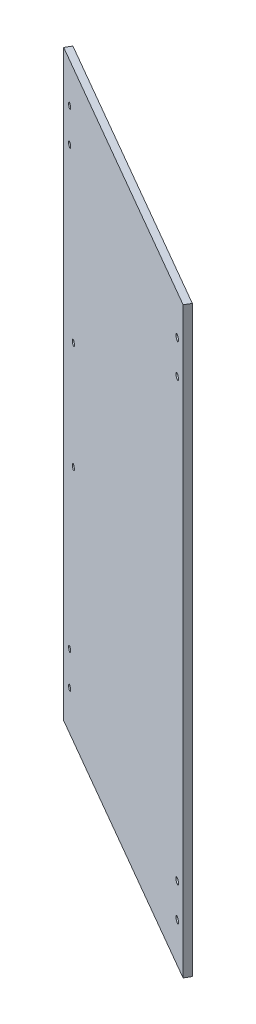
ISO-10303-21;
HEADER;
FILE_DESCRIPTION(('STEP AP214'),'2;1');
FILE_NAME('part.step','',(''),(''),'','','');
FILE_SCHEMA(('AUTOMOTIVE_DESIGN { 1 0 10303 214 1 1 1 1 }'));
ENDSEC;
DATA;
#1=APPLICATION_CONTEXT('core data for automotive mechanical design processes');
#2=APPLICATION_PROTOCOL_DEFINITION('international standard','automotive_design',2000,#1);
#3=PRODUCT_CONTEXT('',#1,'mechanical');
#4=PRODUCT('Part','Part','',(#3));
#5=PRODUCT_RELATED_PRODUCT_CATEGORY('part','',(#4));
#6=PRODUCT_DEFINITION_FORMATION('','',#4);
#7=PRODUCT_DEFINITION_CONTEXT('part definition',#1,'design');
#8=PRODUCT_DEFINITION('design','',#6,#7);
#9=PRODUCT_DEFINITION_SHAPE('','',#8);
#10=(LENGTH_UNIT() NAMED_UNIT(*) SI_UNIT(.MILLI.,.METRE.));
#11=(NAMED_UNIT(*) PLANE_ANGLE_UNIT() SI_UNIT($,.RADIAN.));
#12=(NAMED_UNIT(*) SI_UNIT($,.STERADIAN.) SOLID_ANGLE_UNIT());
#13=UNCERTAINTY_MEASURE_WITH_UNIT(LENGTH_MEASURE(1.E-05),#10,'distance_accuracy_value','');
#14=(GEOMETRIC_REPRESENTATION_CONTEXT(3) GLOBAL_UNCERTAINTY_ASSIGNED_CONTEXT((#13)) GLOBAL_UNIT_ASSIGNED_CONTEXT((#10,
#11,#12)) REPRESENTATION_CONTEXT('',''));
#15=CARTESIAN_POINT('',(0.,0.,0.));
#16=DIRECTION('',(0.,0.,1.));
#17=DIRECTION('',(1.,0.,0.));
#18=AXIS2_PLACEMENT_3D('',#15,#16,#17);
#19=CARTESIAN_POINT('',(-143.512642315571,-14.5,248.571188019025));
#20=DIRECTION('',(0.,-1.,0.));
#21=DIRECTION('',(1.,0.,0.));
#22=AXIS2_PLACEMENT_3D('',#19,#20,#21);
#23=PLANE('',#22);
#24=DIRECTION('',(0.500000000000001,0.,-0.866025403784438));
#25=VECTOR('',#24,1.);
#26=CARTESIAN_POINT('',(-76.0630811519035,-14.5000000000001,-111.024024227066));
#27=LINE('',#26,#25);
#28=CARTESIAN_POINT('',(-23.3937661917119,-14.5,-202.249953737966));
#29=VERTEX_POINT('',#28);
#30=CARTESIAN_POINT('',(-20.8937661917118,-14.5000000000001,-206.580080756888));
#31=VERTEX_POINT('',#30);
#32=EDGE_CURVE('E48',#29,#31,#27,.T.);
#33=ORIENTED_EDGE('',*,*,#32,.T.);
#34=DIRECTION('',(-0.866025403784438,0.,-0.500000000000001));
#35=VECTOR('',#34,1.);
#36=CARTESIAN_POINT('',(84.228357377724,-14.5,-145.887794416289));
#37=LINE('',#36,#35);
#38=CARTESIAN_POINT('',(189.350480947162,-14.5000000000001,-85.1955080756889));
#39=VERTEX_POINT('',#38);
#40=EDGE_CURVE('E185',#39,#31,#37,.T.);
#41=ORIENTED_EDGE('',*,*,#40,.F.);
#42=DIRECTION('',(0.500000000000001,0.,-0.866025403784438));
#43=VECTOR('',#42,1.);
#44=CARTESIAN_POINT('',(134.18116598697,-14.5000000000001,10.3605484541327));
#45=LINE('',#44,#43);
#46=CARTESIAN_POINT('',(186.850480947162,-14.5000000000001,-80.8653810567665));
#47=VERTEX_POINT('',#46);
#48=EDGE_CURVE('E204',#47,#39,#45,.T.);
#49=ORIENTED_EDGE('',*,*,#48,.F.);
#50=DIRECTION('',(0.866025403784438,0.,0.500000000000001));
#51=VECTOR('',#50,1.);
#52=CARTESIAN_POINT('',(81.7283573777238,-14.5,-141.557667397367));
#53=LINE('',#52,#51);
#54=EDGE_CURVE('E189',#29,#47,#53,.T.);
#55=ORIENTED_EDGE('',*,*,#54,.F.);
#56=EDGE_LOOP('',(#33,#41,#49,#55));
#57=FACE_BOUND('',#56,.T.);
#58=ADVANCED_FACE('F33',(#57),#23,.T.);
#59=CARTESIAN_POINT('',(-38.1740123951869,419.25,309.388474359625));
#60=DIRECTION('',(0.,1.,0.));
#61=DIRECTION('',(0.,0.,1.));
#62=AXIS2_PLACEMENT_3D('',#59,#60,#61);
#63=PLANE('',#62);
#64=DIRECTION('',(0.500000000000001,0.,-0.866025403784438));
#65=VECTOR('',#64,1.);
#66=CARTESIAN_POINT('',(-76.0630811519035,419.25,-111.024024227066));
#67=LINE('',#66,#65);
#68=CARTESIAN_POINT('',(-23.3937661917119,419.25,-202.249953737966));
#69=VERTEX_POINT('',#68);
#70=CARTESIAN_POINT('',(-20.8937661917117,419.25,-206.580080756888));
#71=VERTEX_POINT('',#70);
#72=EDGE_CURVE('E169',#69,#71,#67,.T.);
#73=ORIENTED_EDGE('',*,*,#72,.F.);
#74=DIRECTION('',(-0.866025403784438,0.,-0.500000000000001));
#75=VECTOR('',#74,1.);
#76=CARTESIAN_POINT('',(187.066987298108,419.25,-80.7403810567666));
#77=LINE('',#76,#75);
#78=CARTESIAN_POINT('',(186.850480947162,419.25,-80.8653810567665));
#79=VERTEX_POINT('',#78);
#80=EDGE_CURVE('E197',#79,#69,#77,.T.);
#81=ORIENTED_EDGE('',*,*,#80,.F.);
#82=DIRECTION('',(0.500000000000001,0.,-0.866025403784438));
#83=VECTOR('',#82,1.);
#84=CARTESIAN_POINT('',(134.18116598697,419.25,10.3605484541328));
#85=LINE('',#84,#83);
#86=CARTESIAN_POINT('',(189.350480947162,419.25,-85.1955080756888));
#87=VERTEX_POINT('',#86);
#88=EDGE_CURVE('E55',#79,#87,#85,.T.);
#89=ORIENTED_EDGE('',*,*,#88,.T.);
#90=DIRECTION('',(0.866025403784438,0.,0.500000000000001));
#91=VECTOR('',#90,1.);
#92=CARTESIAN_POINT('',(189.566987298108,419.25,-85.0705080756887));
#93=LINE('',#92,#91);
#94=EDGE_CURVE('E183',#71,#87,#93,.T.);
#95=ORIENTED_EDGE('',*,*,#94,.F.);
#96=EDGE_LOOP('',(#73,#81,#89,#95));
#97=FACE_BOUND('',#96,.T.);
#98=ADVANCED_FACE('F35',(#97),#63,.T.);
#99=CARTESIAN_POINT('',(84.228357377725,0.,-145.887794416288));
#100=DIRECTION('',(-0.500000000000001,0.,0.866025403784438));
#101=DIRECTION('',(0.866025403784438,0.,0.500000000000001));
#102=AXIS2_PLACEMENT_3D('',#99,#100,#101);
#103=PLANE('',#102);
#104=CARTESIAN_POINT('',(-3.78976446696915,162.375,-196.705080756888));
#105=DIRECTION('',(-0.500000000000001,0.,0.866025403784438));
#106=DIRECTION('',(0.866025403784438,0.,0.500000000000001));
#107=AXIS2_PLACEMENT_3D('',#104,#105,#106);
#108=CIRCLE('',#107,2.0000000000001);
#109=CARTESIAN_POINT('',(-2.05771365940018,162.375,-195.705080756888));
#110=VERTEX_POINT('',#109);
#111=EDGE_CURVE('E214',#110,#110,#108,.T.);
#112=ORIENTED_EDGE('',*,*,#111,.T.);
#113=EDGE_LOOP('',(#112));
#114=FACE_BOUND('',#113,.T.);
#115=CARTESIAN_POINT('',(-3.78976446696915,242.375,-196.705080756888));
#116=DIRECTION('',(-0.500000000000001,0.,0.866025403784438));
#117=DIRECTION('',(0.866025403784438,0.,0.500000000000001));
#118=AXIS2_PLACEMENT_3D('',#115,#116,#117);
#119=CIRCLE('',#118,2.0000000000001);
#120=CARTESIAN_POINT('',(-2.05771365940018,242.375,-195.705080756888));
#121=VERTEX_POINT('',#120);
#122=EDGE_CURVE('E220',#121,#121,#119,.T.);
#123=ORIENTED_EDGE('',*,*,#122,.T.);
#124=EDGE_LOOP('',(#123));
#125=FACE_BOUND('',#124,.T.);
#126=DIRECTION('',(0.866025403784438,0.,0.500000000000001));
#127=VECTOR('',#126,1.);
#128=CARTESIAN_POINT('',(84.228357377725,12.8749999999999,-145.887794416288));
#129=LINE('',#128,#127);
#130=CARTESIAN_POINT('',(178.525163399856,12.8749999999999,-91.4455080756887));
#131=VERTEX_POINT('',#130);
#132=CARTESIAN_POINT('',(179.391188803641,12.8749999999999,-90.9455080756887));
#133=VERTEX_POINT('',#132);
#134=EDGE_CURVE('E339',#131,#133,#129,.T.);
#135=ORIENTED_EDGE('',*,*,#134,.T.);
#136=CARTESIAN_POINT('',(179.391188803641,14.875,-90.9455080756887));
#137=DIRECTION('',(-0.500000000000001,0.,0.866025403784438));
#138=DIRECTION('',(0.866025403784438,0.,0.500000000000001));
#139=AXIS2_PLACEMENT_3D('',#136,#137,#138);
#140=CIRCLE('',#139,2.00000000000008);
#141=CARTESIAN_POINT('',(179.391188803641,16.8750000000001,-90.9455080756887));
#142=VERTEX_POINT('',#141);
#143=EDGE_CURVE('E344',#133,#142,#140,.T.);
#144=ORIENTED_EDGE('',*,*,#143,.T.);
#145=DIRECTION('',(-0.866025403784438,0.,-0.500000000000001));
#146=VECTOR('',#145,1.);
#147=CARTESIAN_POINT('',(84.228357377725,16.8750000000001,-145.887794416288));
#148=LINE('',#147,#146);
#149=CARTESIAN_POINT('',(178.525163399856,16.8750000000001,-91.4455080756887));
#150=VERTEX_POINT('',#149);
#151=EDGE_CURVE('E331',#142,#150,#148,.T.);
#152=ORIENTED_EDGE('',*,*,#151,.T.);
#153=CARTESIAN_POINT('',(178.525163399856,14.875,-91.4455080756887));
#154=DIRECTION('',(-0.500000000000001,0.,0.866025403784438));
#155=DIRECTION('',(0.866025403784438,0.,0.500000000000001));
#156=AXIS2_PLACEMENT_3D('',#153,#154,#155);
#157=CIRCLE('',#156,2.00000000000008);
#158=EDGE_CURVE('E341',#150,#131,#157,.T.);
#159=ORIENTED_EDGE('',*,*,#158,.T.);
#160=EDGE_LOOP('',(#135,#144,#152,#159));
#161=FACE_BOUND('',#160,.T.);
#162=DIRECTION('',(0.866025403784438,0.,0.500000000000001));
#163=VECTOR('',#162,1.);
#164=CARTESIAN_POINT('',(84.228357377725,37.8749999999999,-145.887794416288));
#165=LINE('',#164,#163);
#166=CARTESIAN_POINT('',(178.525163399856,37.8749999999999,-91.4455080756887));
#167=VERTEX_POINT('',#166);
#168=CARTESIAN_POINT('',(179.391188803641,37.8749999999999,-90.9455080756887));
#169=VERTEX_POINT('',#168);
#170=EDGE_CURVE('E308',#167,#169,#165,.T.);
#171=ORIENTED_EDGE('',*,*,#170,.T.);
#172=CARTESIAN_POINT('',(179.391188803641,39.875,-90.9455080756887));
#173=DIRECTION('',(-0.500000000000001,0.,0.866025403784438));
#174=DIRECTION('',(0.866025403784438,0.,0.500000000000001));
#175=AXIS2_PLACEMENT_3D('',#172,#173,#174);
#176=CIRCLE('',#175,2.00000000000009);
#177=CARTESIAN_POINT('',(179.391188803641,41.8750000000001,-90.9455080756887));
#178=VERTEX_POINT('',#177);
#179=EDGE_CURVE('E313',#169,#178,#176,.T.);
#180=ORIENTED_EDGE('',*,*,#179,.T.);
#181=DIRECTION('',(-0.866025403784438,0.,-0.500000000000001));
#182=VECTOR('',#181,1.);
#183=CARTESIAN_POINT('',(84.228357377725,41.8750000000001,-145.887794416288));
#184=LINE('',#183,#182);
#185=CARTESIAN_POINT('',(178.525163399856,41.8750000000001,-91.4455080756887));
#186=VERTEX_POINT('',#185);
#187=EDGE_CURVE('E300',#178,#186,#184,.T.);
#188=ORIENTED_EDGE('',*,*,#187,.T.);
#189=CARTESIAN_POINT('',(178.525163399856,39.875,-91.4455080756887));
#190=DIRECTION('',(-0.500000000000001,0.,0.866025403784438));
#191=DIRECTION('',(0.866025403784438,0.,0.500000000000001));
#192=AXIS2_PLACEMENT_3D('',#189,#190,#191);
#193=CIRCLE('',#192,2.00000000000009);
#194=EDGE_CURVE('E310',#186,#167,#193,.T.);
#195=ORIENTED_EDGE('',*,*,#194,.T.);
#196=EDGE_LOOP('',(#171,#180,#188,#195));
#197=FACE_BOUND('',#196,.T.);
#198=DIRECTION('',(0.866025403784438,0.,0.500000000000001));
#199=VECTOR('',#198,1.);
#200=CARTESIAN_POINT('',(84.228357377725,362.875,-145.887794416288));
#201=LINE('',#200,#199);
#202=CARTESIAN_POINT('',(178.525163399856,362.875,-91.4455080756887));
#203=VERTEX_POINT('',#202);
#204=CARTESIAN_POINT('',(179.391188803641,362.875,-90.9455080756887));
#205=VERTEX_POINT('',#204);
#206=EDGE_CURVE('E277',#203,#205,#201,.T.);
#207=ORIENTED_EDGE('',*,*,#206,.T.);
#208=CARTESIAN_POINT('',(179.391188803641,364.875,-90.9455080756887));
#209=DIRECTION('',(-0.500000000000001,0.,0.866025403784438));
#210=DIRECTION('',(0.866025403784438,0.,0.500000000000001));
#211=AXIS2_PLACEMENT_3D('',#208,#209,#210);
#212=CIRCLE('',#211,2.);
#213=CARTESIAN_POINT('',(179.391188803641,366.875,-90.9455080756887));
#214=VERTEX_POINT('',#213);
#215=EDGE_CURVE('E282',#205,#214,#212,.T.);
#216=ORIENTED_EDGE('',*,*,#215,.T.);
#217=DIRECTION('',(-0.866025403784438,0.,-0.500000000000001));
#218=VECTOR('',#217,1.);
#219=CARTESIAN_POINT('',(84.228357377725,366.875,-145.887794416288));
#220=LINE('',#219,#218);
#221=CARTESIAN_POINT('',(178.525163399856,366.875,-91.4455080756887));
#222=VERTEX_POINT('',#221);
#223=EDGE_CURVE('E269',#214,#222,#220,.T.);
#224=ORIENTED_EDGE('',*,*,#223,.T.);
#225=CARTESIAN_POINT('',(178.525163399856,364.875,-91.4455080756887));
#226=DIRECTION('',(-0.500000000000001,0.,0.866025403784438));
#227=DIRECTION('',(0.866025403784438,0.,0.500000000000001));
#228=AXIS2_PLACEMENT_3D('',#225,#226,#227);
#229=CIRCLE('',#228,2.);
#230=EDGE_CURVE('E279',#222,#203,#229,.T.);
#231=ORIENTED_EDGE('',*,*,#230,.T.);
#232=EDGE_LOOP('',(#207,#216,#224,#231));
#233=FACE_BOUND('',#232,.T.);
#234=DIRECTION('',(0.866025403784438,0.,0.500000000000001));
#235=VECTOR('',#234,1.);
#236=CARTESIAN_POINT('',(84.228357377725,387.875,-145.887794416288));
#237=LINE('',#236,#235);
#238=CARTESIAN_POINT('',(178.525163399856,387.875,-91.4455080756887));
#239=VERTEX_POINT('',#238);
#240=CARTESIAN_POINT('',(179.391188803641,387.875,-90.9455080756887));
#241=VERTEX_POINT('',#240);
#242=EDGE_CURVE('E246',#239,#241,#237,.T.);
#243=ORIENTED_EDGE('',*,*,#242,.T.);
#244=CARTESIAN_POINT('',(179.391188803641,389.875,-90.9455080756887));
#245=DIRECTION('',(-0.500000000000001,0.,0.866025403784438));
#246=DIRECTION('',(0.866025403784438,0.,0.500000000000001));
#247=AXIS2_PLACEMENT_3D('',#244,#245,#246);
#248=CIRCLE('',#247,2.);
#249=CARTESIAN_POINT('',(179.391188803641,391.875,-90.9455080756887));
#250=VERTEX_POINT('',#249);
#251=EDGE_CURVE('E251',#241,#250,#248,.T.);
#252=ORIENTED_EDGE('',*,*,#251,.T.);
#253=DIRECTION('',(-0.866025403784438,0.,-0.500000000000001));
#254=VECTOR('',#253,1.);
#255=CARTESIAN_POINT('',(84.228357377725,391.875,-145.887794416288));
#256=LINE('',#255,#254);
#257=CARTESIAN_POINT('',(178.525163399856,391.875,-91.4455080756887));
#258=VERTEX_POINT('',#257);
#259=EDGE_CURVE('E238',#250,#258,#256,.T.);
#260=ORIENTED_EDGE('',*,*,#259,.T.);
#261=CARTESIAN_POINT('',(178.525163399856,389.875,-91.4455080756887));
#262=DIRECTION('',(-0.500000000000001,0.,0.866025403784438));
#263=DIRECTION('',(0.866025403784438,0.,0.500000000000001));
#264=AXIS2_PLACEMENT_3D('',#261,#262,#263);
#265=CIRCLE('',#264,2.);
#266=EDGE_CURVE('E248',#258,#239,#265,.T.);
#267=ORIENTED_EDGE('',*,*,#266,.T.);
#268=EDGE_LOOP('',(#243,#252,#260,#267));
#269=FACE_BOUND('',#268,.T.);
#270=ORIENTED_EDGE('',*,*,#40,.T.);
#271=DIRECTION('',(0.,-1.,0.));
#272=VECTOR('',#271,1.);
#273=CARTESIAN_POINT('',(-20.8937661917117,419.25,-206.580080756888));
#274=LINE('',#273,#272);
#275=EDGE_CURVE('E172',#71,#31,#274,.T.);
#276=ORIENTED_EDGE('',*,*,#275,.F.);
#277=ORIENTED_EDGE('',*,*,#94,.T.);
#278=DIRECTION('',(0.,1.,0.));
#279=VECTOR('',#278,1.);
#280=CARTESIAN_POINT('',(189.350480947162,419.25,-85.1955080756888));
#281=LINE('',#280,#279);
#282=EDGE_CURVE('E206',#39,#87,#281,.T.);
#283=ORIENTED_EDGE('',*,*,#282,.F.);
#284=EDGE_LOOP('',(#270,#276,#277,#283));
#285=FACE_BOUND('',#284,.T.);
#286=CARTESIAN_POINT('',(-10.5014613462985,14.875,-200.580080756888));
#287=DIRECTION('',(-0.500000000000001,0.,0.866025403784438));
#288=DIRECTION('',(0.866025403784438,0.,0.500000000000001));
#289=AXIS2_PLACEMENT_3D('',#286,#287,#288);
#290=CIRCLE('',#289,2.00000000000007);
#291=CARTESIAN_POINT('',(-8.76941053872958,14.875,-199.580080756888));
#292=VERTEX_POINT('',#291);
#293=EDGE_CURVE('E347',#292,#292,#290,.T.);
#294=ORIENTED_EDGE('',*,*,#293,.T.);
#295=EDGE_LOOP('',(#294));
#296=FACE_BOUND('',#295,.T.);
#297=CARTESIAN_POINT('',(-10.5014613462985,39.875,-200.580080756888));
#298=DIRECTION('',(-0.500000000000001,0.,0.866025403784438));
#299=DIRECTION('',(0.866025403784438,0.,0.500000000000001));
#300=AXIS2_PLACEMENT_3D('',#297,#298,#299);
#301=CIRCLE('',#300,2.00000000000007);
#302=CARTESIAN_POINT('',(-8.76941053872958,39.875,-199.580080756888));
#303=VERTEX_POINT('',#302);
#304=EDGE_CURVE('E351',#303,#303,#301,.T.);
#305=ORIENTED_EDGE('',*,*,#304,.T.);
#306=EDGE_LOOP('',(#305));
#307=FACE_BOUND('',#306,.T.);
#308=CARTESIAN_POINT('',(-10.5014613462987,364.875,-200.580080756888));
#309=DIRECTION('',(-0.500000000000001,0.,0.866025403784438));
#310=DIRECTION('',(0.866025403784438,0.,0.500000000000001));
#311=AXIS2_PLACEMENT_3D('',#308,#309,#310);
#312=CIRCLE('',#311,2.00000000000001);
#313=CARTESIAN_POINT('',(-8.76941053872982,364.875,-199.580080756888));
#314=VERTEX_POINT('',#313);
#315=EDGE_CURVE('E355',#314,#314,#312,.T.);
#316=ORIENTED_EDGE('',*,*,#315,.T.);
#317=EDGE_LOOP('',(#316));
#318=FACE_BOUND('',#317,.T.);
#319=CARTESIAN_POINT('',(-10.5014613462987,389.875,-200.580080756888));
#320=DIRECTION('',(-0.500000000000001,0.,0.866025403784438));
#321=DIRECTION('',(0.866025403784438,0.,0.500000000000001));
#322=AXIS2_PLACEMENT_3D('',#319,#320,#321);
#323=CIRCLE('',#322,2.00000000000001);
#324=CARTESIAN_POINT('',(-8.76941053872983,389.875,-199.580080756888));
#325=VERTEX_POINT('',#324);
#326=EDGE_CURVE('E192',#325,#325,#323,.T.);
#327=ORIENTED_EDGE('',*,*,#326,.T.);
#328=EDGE_LOOP('',(#327));
#329=FACE_BOUND('',#328,.T.);
#330=ADVANCED_FACE('F180',(#114,#125,#161,#197,#233,#269,#285,#296,#307,#318,#329),#103,.F.);
#331=CARTESIAN_POINT('',(81.7283573777249,0.,-141.557667397366));
#332=DIRECTION('',(0.500000000000001,0.,-0.866025403784438));
#333=DIRECTION('',(-0.866025403784438,0.,-0.500000000000001));
#334=AXIS2_PLACEMENT_3D('',#331,#332,#333);
#335=PLANE('',#334);
#336=CARTESIAN_POINT('',(-6.28976446696923,162.375,-192.374953737966));
#337=DIRECTION('',(-0.500000000000001,0.,0.866025403784438));
#338=DIRECTION('',(0.866025403784438,0.,0.500000000000001));
#339=AXIS2_PLACEMENT_3D('',#336,#337,#338);
#340=CIRCLE('',#339,2.0000000000001);
#341=CARTESIAN_POINT('',(-4.55771365940026,162.375,-191.374953737965));
#342=VERTEX_POINT('',#341);
#343=EDGE_CURVE('E208',#342,#342,#340,.T.);
#344=ORIENTED_EDGE('',*,*,#343,.F.);
#345=EDGE_LOOP('',(#344));
#346=FACE_BOUND('',#345,.T.);
#347=CARTESIAN_POINT('',(-6.28976446696923,242.375,-192.374953737966));
#348=DIRECTION('',(-0.500000000000001,0.,0.866025403784438));
#349=DIRECTION('',(0.866025403784438,0.,0.500000000000001));
#350=AXIS2_PLACEMENT_3D('',#347,#348,#349);
#351=CIRCLE('',#350,2.0000000000001);
#352=CARTESIAN_POINT('',(-4.55771365940026,242.375,-191.374953737965));
#353=VERTEX_POINT('',#352);
#354=EDGE_CURVE('E217',#353,#353,#351,.T.);
#355=ORIENTED_EDGE('',*,*,#354,.F.);
#356=EDGE_LOOP('',(#355));
#357=FACE_BOUND('',#356,.T.);
#358=DIRECTION('',(-0.866025403784439,0.,-0.499999999999998));
#359=VECTOR('',#358,1.);
#360=CARTESIAN_POINT('',(176.891188803641,16.8750000000001,-86.6153810567664));
#361=LINE('',#360,#359);
#362=CARTESIAN_POINT('',(176.891188803641,16.8750000000001,-86.6153810567664));
#363=VERTEX_POINT('',#362);
#364=CARTESIAN_POINT('',(176.025163399856,16.8750000000001,-87.1153810567664));
#365=VERTEX_POINT('',#364);
#366=EDGE_CURVE('E319',#363,#365,#361,.T.);
#367=ORIENTED_EDGE('',*,*,#366,.F.);
#368=CARTESIAN_POINT('',(176.891188803641,14.875,-86.6153810567664));
#369=DIRECTION('',(-0.500000000000001,0.,0.866025403784438));
#370=DIRECTION('',(0.866025403784438,0.,0.500000000000001));
#371=AXIS2_PLACEMENT_3D('',#368,#369,#370);
#372=CIRCLE('',#371,2.00000000000008);
#373=CARTESIAN_POINT('',(176.891188803641,12.8749999999999,-86.6153810567664));
#374=VERTEX_POINT('',#373);
#375=EDGE_CURVE('E316',#374,#363,#372,.T.);
#376=ORIENTED_EDGE('',*,*,#375,.F.);
#377=DIRECTION('',(0.866025403784439,0.,0.499999999999998));
#378=VECTOR('',#377,1.);
#379=CARTESIAN_POINT('',(176.891188803641,12.8749999999999,-86.6153810567664));
#380=LINE('',#379,#378);
#381=CARTESIAN_POINT('',(176.025163399856,12.8749999999999,-87.1153810567664));
#382=VERTEX_POINT('',#381);
#383=EDGE_CURVE('E325',#382,#374,#380,.T.);
#384=ORIENTED_EDGE('',*,*,#383,.F.);
#385=CARTESIAN_POINT('',(176.025163399856,14.875,-87.1153810567664));
#386=DIRECTION('',(-0.500000000000001,0.,0.866025403784438));
#387=DIRECTION('',(0.866025403784438,0.,0.500000000000001));
#388=AXIS2_PLACEMENT_3D('',#385,#386,#387);
#389=CIRCLE('',#388,2.00000000000008);
#390=EDGE_CURVE('E322',#365,#382,#389,.T.);
#391=ORIENTED_EDGE('',*,*,#390,.F.);
#392=EDGE_LOOP('',(#367,#376,#384,#391));
#393=FACE_BOUND('',#392,.T.);
#394=DIRECTION('',(-0.866025403784439,0.,-0.499999999999998));
#395=VECTOR('',#394,1.);
#396=CARTESIAN_POINT('',(176.891188803641,41.8750000000001,-86.6153810567664));
#397=LINE('',#396,#395);
#398=CARTESIAN_POINT('',(176.891188803641,41.8750000000001,-86.6153810567664));
#399=VERTEX_POINT('',#398);
#400=CARTESIAN_POINT('',(176.025163399856,41.8750000000001,-87.1153810567664));
#401=VERTEX_POINT('',#400);
#402=EDGE_CURVE('E288',#399,#401,#397,.T.);
#403=ORIENTED_EDGE('',*,*,#402,.F.);
#404=CARTESIAN_POINT('',(176.891188803641,39.875,-86.6153810567664));
#405=DIRECTION('',(-0.500000000000001,0.,0.866025403784438));
#406=DIRECTION('',(0.866025403784438,0.,0.500000000000001));
#407=AXIS2_PLACEMENT_3D('',#404,#405,#406);
#408=CIRCLE('',#407,2.00000000000009);
#409=CARTESIAN_POINT('',(176.891188803641,37.8749999999999,-86.6153810567664));
#410=VERTEX_POINT('',#409);
#411=EDGE_CURVE('E285',#410,#399,#408,.T.);
#412=ORIENTED_EDGE('',*,*,#411,.F.);
#413=DIRECTION('',(0.866025403784439,0.,0.499999999999998));
#414=VECTOR('',#413,1.);
#415=CARTESIAN_POINT('',(176.891188803641,37.8749999999999,-86.6153810567664));
#416=LINE('',#415,#414);
#417=CARTESIAN_POINT('',(176.025163399856,37.8749999999999,-87.1153810567664));
#418=VERTEX_POINT('',#417);
#419=EDGE_CURVE('E294',#418,#410,#416,.T.);
#420=ORIENTED_EDGE('',*,*,#419,.F.);
#421=CARTESIAN_POINT('',(176.025163399856,39.875,-87.1153810567664));
#422=DIRECTION('',(-0.500000000000001,0.,0.866025403784438));
#423=DIRECTION('',(0.866025403784438,0.,0.500000000000001));
#424=AXIS2_PLACEMENT_3D('',#421,#422,#423);
#425=CIRCLE('',#424,2.00000000000009);
#426=EDGE_CURVE('E291',#401,#418,#425,.T.);
#427=ORIENTED_EDGE('',*,*,#426,.F.);
#428=EDGE_LOOP('',(#403,#412,#420,#427));
#429=FACE_BOUND('',#428,.T.);
#430=DIRECTION('',(-0.866025403784439,0.,-0.499999999999998));
#431=VECTOR('',#430,1.);
#432=CARTESIAN_POINT('',(176.891188803641,366.875,-86.6153810567664));
#433=LINE('',#432,#431);
#434=CARTESIAN_POINT('',(176.891188803641,366.875,-86.6153810567664));
#435=VERTEX_POINT('',#434);
#436=CARTESIAN_POINT('',(176.025163399856,366.875,-87.1153810567664));
#437=VERTEX_POINT('',#436);
#438=EDGE_CURVE('E257',#435,#437,#433,.T.);
#439=ORIENTED_EDGE('',*,*,#438,.F.);
#440=CARTESIAN_POINT('',(176.891188803641,364.875,-86.6153810567664));
#441=DIRECTION('',(-0.500000000000001,0.,0.866025403784438));
#442=DIRECTION('',(0.866025403784438,0.,0.500000000000001));
#443=AXIS2_PLACEMENT_3D('',#440,#441,#442);
#444=CIRCLE('',#443,2.);
#445=CARTESIAN_POINT('',(176.891188803641,362.875,-86.6153810567664));
#446=VERTEX_POINT('',#445);
#447=EDGE_CURVE('E254',#446,#435,#444,.T.);
#448=ORIENTED_EDGE('',*,*,#447,.F.);
#449=DIRECTION('',(0.866025403784439,0.,0.499999999999998));
#450=VECTOR('',#449,1.);
#451=CARTESIAN_POINT('',(176.891188803641,362.875,-86.6153810567664));
#452=LINE('',#451,#450);
#453=CARTESIAN_POINT('',(176.025163399856,362.875,-87.1153810567664));
#454=VERTEX_POINT('',#453);
#455=EDGE_CURVE('E263',#454,#446,#452,.T.);
#456=ORIENTED_EDGE('',*,*,#455,.F.);
#457=CARTESIAN_POINT('',(176.025163399856,364.875,-87.1153810567664));
#458=DIRECTION('',(-0.500000000000001,0.,0.866025403784438));
#459=DIRECTION('',(0.866025403784438,0.,0.500000000000001));
#460=AXIS2_PLACEMENT_3D('',#457,#458,#459);
#461=CIRCLE('',#460,2.);
#462=EDGE_CURVE('E260',#437,#454,#461,.T.);
#463=ORIENTED_EDGE('',*,*,#462,.F.);
#464=EDGE_LOOP('',(#439,#448,#456,#463));
#465=FACE_BOUND('',#464,.T.);
#466=DIRECTION('',(-0.866025403784439,0.,-0.499999999999998));
#467=VECTOR('',#466,1.);
#468=CARTESIAN_POINT('',(176.891188803641,391.875,-86.6153810567664));
#469=LINE('',#468,#467);
#470=CARTESIAN_POINT('',(176.891188803641,391.875,-86.6153810567664));
#471=VERTEX_POINT('',#470);
#472=CARTESIAN_POINT('',(176.025163399856,391.875,-87.1153810567664));
#473=VERTEX_POINT('',#472);
#474=EDGE_CURVE('E226',#471,#473,#469,.T.);
#475=ORIENTED_EDGE('',*,*,#474,.F.);
#476=CARTESIAN_POINT('',(176.891188803641,389.875,-86.6153810567664));
#477=DIRECTION('',(-0.500000000000001,0.,0.866025403784438));
#478=DIRECTION('',(0.866025403784438,0.,0.500000000000001));
#479=AXIS2_PLACEMENT_3D('',#476,#477,#478);
#480=CIRCLE('',#479,2.);
#481=CARTESIAN_POINT('',(176.891188803641,387.875,-86.6153810567664));
#482=VERTEX_POINT('',#481);
#483=EDGE_CURVE('E223',#482,#471,#480,.T.);
#484=ORIENTED_EDGE('',*,*,#483,.F.);
#485=DIRECTION('',(0.866025403784439,0.,0.499999999999998));
#486=VECTOR('',#485,1.);
#487=CARTESIAN_POINT('',(176.891188803641,387.875,-86.6153810567664));
#488=LINE('',#487,#486);
#489=CARTESIAN_POINT('',(176.025163399856,387.875,-87.1153810567664));
#490=VERTEX_POINT('',#489);
#491=EDGE_CURVE('E232',#490,#482,#488,.T.);
#492=ORIENTED_EDGE('',*,*,#491,.F.);
#493=CARTESIAN_POINT('',(176.025163399856,389.875,-87.1153810567664));
#494=DIRECTION('',(-0.500000000000001,0.,0.866025403784438));
#495=DIRECTION('',(0.866025403784438,0.,0.500000000000001));
#496=AXIS2_PLACEMENT_3D('',#493,#494,#495);
#497=CIRCLE('',#496,2.);
#498=EDGE_CURVE('E229',#473,#490,#497,.T.);
#499=ORIENTED_EDGE('',*,*,#498,.F.);
#500=EDGE_LOOP('',(#475,#484,#492,#499));
#501=FACE_BOUND('',#500,.T.);
#502=ORIENTED_EDGE('',*,*,#80,.T.);
#503=DIRECTION('',(0.,-1.,0.));
#504=VECTOR('',#503,1.);
#505=CARTESIAN_POINT('',(-23.393766191712,0.,-202.249953737966));
#506=LINE('',#505,#504);
#507=EDGE_CURVE('E11',#69,#29,#506,.T.);
#508=ORIENTED_EDGE('',*,*,#507,.T.);
#509=ORIENTED_EDGE('',*,*,#54,.T.);
#510=DIRECTION('',(0.,1.,0.));
#511=VECTOR('',#510,1.);
#512=CARTESIAN_POINT('',(186.850480947162,0.,-80.8653810567665));
#513=LINE('',#512,#511);
#514=EDGE_CURVE('E41',#47,#79,#513,.T.);
#515=ORIENTED_EDGE('',*,*,#514,.T.);
#516=EDGE_LOOP('',(#502,#508,#509,#515));
#517=FACE_BOUND('',#516,.T.);
#518=CARTESIAN_POINT('',(-13.0014613462987,14.875,-196.249953737966));
#519=DIRECTION('',(-0.500000000000001,0.,0.866025403784438));
#520=DIRECTION('',(0.866025403784438,0.,0.500000000000001));
#521=AXIS2_PLACEMENT_3D('',#518,#519,#520);
#522=CIRCLE('',#521,2.00000000000007);
#523=CARTESIAN_POINT('',(-11.2694105387297,14.875,-195.249953737966));
#524=VERTEX_POINT('',#523);
#525=EDGE_CURVE('E350',#524,#524,#522,.T.);
#526=ORIENTED_EDGE('',*,*,#525,.F.);
#527=EDGE_LOOP('',(#526));
#528=FACE_BOUND('',#527,.T.);
#529=CARTESIAN_POINT('',(-13.0014613462987,39.875,-196.249953737966));
#530=DIRECTION('',(-0.500000000000001,0.,0.866025403784438));
#531=DIRECTION('',(0.866025403784438,0.,0.500000000000001));
#532=AXIS2_PLACEMENT_3D('',#529,#530,#531);
#533=CIRCLE('',#532,2.00000000000007);
#534=CARTESIAN_POINT('',(-11.2694105387297,39.875,-195.249953737966));
#535=VERTEX_POINT('',#534);
#536=EDGE_CURVE('E354',#535,#535,#533,.T.);
#537=ORIENTED_EDGE('',*,*,#536,.F.);
#538=EDGE_LOOP('',(#537));
#539=FACE_BOUND('',#538,.T.);
#540=CARTESIAN_POINT('',(-13.0014613462988,364.875,-196.249953737966));
#541=DIRECTION('',(-0.500000000000001,0.,0.866025403784438));
#542=DIRECTION('',(0.866025403784438,0.,0.500000000000001));
#543=AXIS2_PLACEMENT_3D('',#540,#541,#542);
#544=CIRCLE('',#543,2.00000000000001);
#545=CARTESIAN_POINT('',(-11.2694105387299,364.875,-195.249953737966));
#546=VERTEX_POINT('',#545);
#547=EDGE_CURVE('E358',#546,#546,#544,.T.);
#548=ORIENTED_EDGE('',*,*,#547,.F.);
#549=EDGE_LOOP('',(#548));
#550=FACE_BOUND('',#549,.T.);
#551=CARTESIAN_POINT('',(-13.0014613462988,389.875,-196.249953737966));
#552=DIRECTION('',(-0.500000000000001,0.,0.866025403784438));
#553=DIRECTION('',(0.866025403784438,0.,0.500000000000001));
#554=AXIS2_PLACEMENT_3D('',#551,#552,#553);
#555=CIRCLE('',#554,2.00000000000001);
#556=CARTESIAN_POINT('',(-11.2694105387299,389.875,-195.249953737966));
#557=VERTEX_POINT('',#556);
#558=EDGE_CURVE('E187',#557,#557,#555,.T.);
#559=ORIENTED_EDGE('',*,*,#558,.F.);
#560=EDGE_LOOP('',(#559));
#561=FACE_BOUND('',#560,.T.);
#562=ADVANCED_FACE('F199',(#346,#357,#393,#429,#465,#501,#517,#528,#539,#550,#561),#335,.F.);
#563=CARTESIAN_POINT('',(-95.4334643645986,389.875,-53.4735363405997));
#564=DIRECTION('',(0.500000000000001,0.,-0.866025403784438));
#565=DIRECTION('',(0.866025403784438,0.,0.500000000000001));
#566=AXIS2_PLACEMENT_3D('',#563,#564,#565);
#567=CYLINDRICAL_SURFACE('',#566,2.00000000000001);
#568=ORIENTED_EDGE('',*,*,#326,.F.);
#569=EDGE_LOOP('',(#568));
#570=FACE_BOUND('',#569,.T.);
#571=ORIENTED_EDGE('',*,*,#558,.T.);
#572=EDGE_LOOP('',(#571));
#573=FACE_BOUND('',#572,.T.);
#574=ADVANCED_FACE('F370',(#570,#573),#567,.F.);
#575=CARTESIAN_POINT('',(-95.4334643645986,364.875,-53.4735363405997));
#576=DIRECTION('',(0.500000000000001,0.,-0.866025403784438));
#577=DIRECTION('',(0.866025403784438,0.,0.500000000000001));
#578=AXIS2_PLACEMENT_3D('',#575,#576,#577);
#579=CYLINDRICAL_SURFACE('',#578,2.00000000000001);
#580=ORIENTED_EDGE('',*,*,#315,.F.);
#581=EDGE_LOOP('',(#580));
#582=FACE_BOUND('',#581,.T.);
#583=ORIENTED_EDGE('',*,*,#547,.T.);
#584=EDGE_LOOP('',(#583));
#585=FACE_BOUND('',#584,.T.);
#586=ADVANCED_FACE('F380',(#582,#585),#579,.F.);
#587=CARTESIAN_POINT('',(-95.4334643645984,39.875,-53.4735363405996));
#588=DIRECTION('',(0.500000000000001,0.,-0.866025403784438));
#589=DIRECTION('',(0.866025403784438,0.,0.500000000000001));
#590=AXIS2_PLACEMENT_3D('',#587,#588,#589);
#591=CYLINDRICAL_SURFACE('',#590,2.00000000000007);
#592=ORIENTED_EDGE('',*,*,#304,.F.);
#593=EDGE_LOOP('',(#592));
#594=FACE_BOUND('',#593,.T.);
#595=ORIENTED_EDGE('',*,*,#536,.T.);
#596=EDGE_LOOP('',(#595));
#597=FACE_BOUND('',#596,.T.);
#598=ADVANCED_FACE('F386',(#594,#597),#591,.F.);
#599=CARTESIAN_POINT('',(-95.4334643645984,14.875,-53.4735363405996));
#600=DIRECTION('',(0.500000000000001,0.,-0.866025403784438));
#601=DIRECTION('',(0.866025403784438,0.,0.500000000000001));
#602=AXIS2_PLACEMENT_3D('',#599,#600,#601);
#603=CYLINDRICAL_SURFACE('',#602,2.00000000000007);
#604=ORIENTED_EDGE('',*,*,#293,.F.);
#605=EDGE_LOOP('',(#604));
#606=FACE_BOUND('',#605,.T.);
#607=ORIENTED_EDGE('',*,*,#525,.T.);
#608=EDGE_LOOP('',(#607));
#609=FACE_BOUND('',#608,.T.);
#610=ADVANCED_FACE('F367',(#606,#609),#603,.F.);
#611=CARTESIAN_POINT('',(232.060503763832,14.875,-182.171437586588));
#612=DIRECTION('',(-0.500000000000001,0.,0.866025403784438));
#613=DIRECTION('',(0.866025403784438,0.,0.500000000000001));
#614=AXIS2_PLACEMENT_3D('',#611,#612,#613);
#615=CYLINDRICAL_SURFACE('',#614,2.00000000000008);
#616=DIRECTION('',(-0.500000000000001,0.,0.866025403784438));
#617=VECTOR('',#616,1.);
#618=CARTESIAN_POINT('',(232.060503763832,12.8749999999999,-182.171437586588));
#619=LINE('',#618,#617);
#620=EDGE_CURVE('E328',#133,#374,#619,.T.);
#621=ORIENTED_EDGE('',*,*,#620,.T.);
#622=ORIENTED_EDGE('',*,*,#375,.T.);
#623=DIRECTION('',(-0.500000000000001,0.,0.866025403784438));
#624=VECTOR('',#623,1.);
#625=CARTESIAN_POINT('',(232.060503763832,16.8750000000001,-182.171437586588));
#626=LINE('',#625,#624);
#627=EDGE_CURVE('E327',#142,#363,#626,.T.);
#628=ORIENTED_EDGE('',*,*,#627,.F.);
#629=ORIENTED_EDGE('',*,*,#143,.F.);
#630=EDGE_LOOP('',(#621,#622,#628,#629));
#631=FACE_BOUND('',#630,.T.);
#632=ADVANCED_FACE('F480',(#631),#615,.F.);
#633=CARTESIAN_POINT('',(231.194478360048,14.875,-182.671437586588));
#634=DIRECTION('',(-0.500000000000001,0.,0.866025403784438));
#635=DIRECTION('',(0.866025403784438,0.,0.500000000000001));
#636=AXIS2_PLACEMENT_3D('',#633,#634,#635);
#637=CYLINDRICAL_SURFACE('',#636,2.00000000000008);
#638=DIRECTION('',(-0.500000000000001,0.,0.866025403784438));
#639=VECTOR('',#638,1.);
#640=CARTESIAN_POINT('',(231.194478360048,16.8750000000001,-182.671437586588));
#641=LINE('',#640,#639);
#642=EDGE_CURVE('E334',#150,#365,#641,.T.);
#643=ORIENTED_EDGE('',*,*,#642,.T.);
#644=ORIENTED_EDGE('',*,*,#390,.T.);
#645=DIRECTION('',(-0.500000000000001,0.,0.866025403784438));
#646=VECTOR('',#645,1.);
#647=CARTESIAN_POINT('',(231.194478360048,12.8749999999999,-182.671437586588));
#648=LINE('',#647,#646);
#649=EDGE_CURVE('E332',#131,#382,#648,.T.);
#650=ORIENTED_EDGE('',*,*,#649,.F.);
#651=ORIENTED_EDGE('',*,*,#158,.F.);
#652=EDGE_LOOP('',(#643,#644,#650,#651));
#653=FACE_BOUND('',#652,.T.);
#654=ADVANCED_FACE('F476',(#653),#637,.F.);
#655=CARTESIAN_POINT('',(232.060503763832,12.8749999999999,-182.171437586588));
#656=DIRECTION('',(0.,-1.,0.));
#657=DIRECTION('',(0.,0.,-1.));
#658=AXIS2_PLACEMENT_3D('',#655,#656,#657);
#659=PLANE('',#658);
#660=ORIENTED_EDGE('',*,*,#649,.T.);
#661=ORIENTED_EDGE('',*,*,#383,.T.);
#662=ORIENTED_EDGE('',*,*,#620,.F.);
#663=ORIENTED_EDGE('',*,*,#134,.F.);
#664=EDGE_LOOP('',(#660,#661,#662,#663));
#665=FACE_BOUND('',#664,.T.);
#666=ADVANCED_FACE('F473',(#665),#659,.F.);
#667=CARTESIAN_POINT('',(232.060503763832,16.8750000000001,-182.171437586588));
#668=DIRECTION('',(0.,1.,0.));
#669=DIRECTION('',(0.,0.,1.));
#670=AXIS2_PLACEMENT_3D('',#667,#668,#669);
#671=PLANE('',#670);
#672=ORIENTED_EDGE('',*,*,#627,.T.);
#673=ORIENTED_EDGE('',*,*,#366,.T.);
#674=ORIENTED_EDGE('',*,*,#642,.F.);
#675=ORIENTED_EDGE('',*,*,#151,.F.);
#676=EDGE_LOOP('',(#672,#673,#674,#675));
#677=FACE_BOUND('',#676,.T.);
#678=ADVANCED_FACE('F471',(#677),#671,.F.);
#679=CARTESIAN_POINT('',(232.060503763832,39.875,-182.171437586588));
#680=DIRECTION('',(-0.500000000000001,0.,0.866025403784438));
#681=DIRECTION('',(0.866025403784438,0.,0.500000000000001));
#682=AXIS2_PLACEMENT_3D('',#679,#680,#681);
#683=CYLINDRICAL_SURFACE('',#682,2.00000000000009);
#684=DIRECTION('',(-0.500000000000001,0.,0.866025403784438));
#685=VECTOR('',#684,1.);
#686=CARTESIAN_POINT('',(232.060503763832,37.8749999999999,-182.171437586588));
#687=LINE('',#686,#685);
#688=EDGE_CURVE('E297',#169,#410,#687,.T.);
#689=ORIENTED_EDGE('',*,*,#688,.T.);
#690=ORIENTED_EDGE('',*,*,#411,.T.);
#691=DIRECTION('',(-0.500000000000001,0.,0.866025403784438));
#692=VECTOR('',#691,1.);
#693=CARTESIAN_POINT('',(232.060503763832,41.8750000000001,-182.171437586588));
#694=LINE('',#693,#692);
#695=EDGE_CURVE('E296',#178,#399,#694,.T.);
#696=ORIENTED_EDGE('',*,*,#695,.F.);
#697=ORIENTED_EDGE('',*,*,#179,.F.);
#698=EDGE_LOOP('',(#689,#690,#696,#697));
#699=FACE_BOUND('',#698,.T.);
#700=ADVANCED_FACE('F464',(#699),#683,.F.);
#701=CARTESIAN_POINT('',(231.194478360048,39.875,-182.671437586588));
#702=DIRECTION('',(-0.500000000000001,0.,0.866025403784438));
#703=DIRECTION('',(0.866025403784438,0.,0.500000000000001));
#704=AXIS2_PLACEMENT_3D('',#701,#702,#703);
#705=CYLINDRICAL_SURFACE('',#704,2.00000000000009);
#706=DIRECTION('',(-0.500000000000001,0.,0.866025403784438));
#707=VECTOR('',#706,1.);
#708=CARTESIAN_POINT('',(231.194478360048,41.8750000000001,-182.671437586588));
#709=LINE('',#708,#707);
#710=EDGE_CURVE('E303',#186,#401,#709,.T.);
#711=ORIENTED_EDGE('',*,*,#710,.T.);
#712=ORIENTED_EDGE('',*,*,#426,.T.);
#713=DIRECTION('',(-0.500000000000001,0.,0.866025403784438));
#714=VECTOR('',#713,1.);
#715=CARTESIAN_POINT('',(231.194478360048,37.8749999999999,-182.671437586588));
#716=LINE('',#715,#714);
#717=EDGE_CURVE('E301',#167,#418,#716,.T.);
#718=ORIENTED_EDGE('',*,*,#717,.F.);
#719=ORIENTED_EDGE('',*,*,#194,.F.);
#720=EDGE_LOOP('',(#711,#712,#718,#719));
#721=FACE_BOUND('',#720,.T.);
#722=ADVANCED_FACE('F460',(#721),#705,.F.);
#723=CARTESIAN_POINT('',(232.060503763832,37.8749999999999,-182.171437586588));
#724=DIRECTION('',(0.,-1.,0.));
#725=DIRECTION('',(0.,0.,-1.));
#726=AXIS2_PLACEMENT_3D('',#723,#724,#725);
#727=PLANE('',#726);
#728=ORIENTED_EDGE('',*,*,#717,.T.);
#729=ORIENTED_EDGE('',*,*,#419,.T.);
#730=ORIENTED_EDGE('',*,*,#688,.F.);
#731=ORIENTED_EDGE('',*,*,#170,.F.);
#732=EDGE_LOOP('',(#728,#729,#730,#731));
#733=FACE_BOUND('',#732,.T.);
#734=ADVANCED_FACE('F457',(#733),#727,.F.);
#735=CARTESIAN_POINT('',(232.060503763832,41.8750000000001,-182.171437586588));
#736=DIRECTION('',(0.,1.,0.));
#737=DIRECTION('',(0.,0.,1.));
#738=AXIS2_PLACEMENT_3D('',#735,#736,#737);
#739=PLANE('',#738);
#740=ORIENTED_EDGE('',*,*,#695,.T.);
#741=ORIENTED_EDGE('',*,*,#402,.T.);
#742=ORIENTED_EDGE('',*,*,#710,.F.);
#743=ORIENTED_EDGE('',*,*,#187,.F.);
#744=EDGE_LOOP('',(#740,#741,#742,#743));
#745=FACE_BOUND('',#744,.T.);
#746=ADVANCED_FACE('F455',(#745),#739,.F.);
#747=CARTESIAN_POINT('',(232.060503763832,364.875,-182.171437586588));
#748=DIRECTION('',(-0.500000000000001,0.,0.866025403784438));
#749=DIRECTION('',(0.866025403784438,0.,0.500000000000001));
#750=AXIS2_PLACEMENT_3D('',#747,#748,#749);
#751=CYLINDRICAL_SURFACE('',#750,2.);
#752=DIRECTION('',(-0.500000000000001,0.,0.866025403784438));
#753=VECTOR('',#752,1.);
#754=CARTESIAN_POINT('',(232.060503763832,362.875,-182.171437586588));
#755=LINE('',#754,#753);
#756=EDGE_CURVE('E266',#205,#446,#755,.T.);
#757=ORIENTED_EDGE('',*,*,#756,.T.);
#758=ORIENTED_EDGE('',*,*,#447,.T.);
#759=DIRECTION('',(-0.500000000000001,0.,0.866025403784438));
#760=VECTOR('',#759,1.);
#761=CARTESIAN_POINT('',(232.060503763832,366.875,-182.171437586588));
#762=LINE('',#761,#760);
#763=EDGE_CURVE('E265',#214,#435,#762,.T.);
#764=ORIENTED_EDGE('',*,*,#763,.F.);
#765=ORIENTED_EDGE('',*,*,#215,.F.);
#766=EDGE_LOOP('',(#757,#758,#764,#765));
#767=FACE_BOUND('',#766,.T.);
#768=ADVANCED_FACE('F448',(#767),#751,.F.);
#769=CARTESIAN_POINT('',(231.194478360048,364.875,-182.671437586588));
#770=DIRECTION('',(-0.500000000000001,0.,0.866025403784438));
#771=DIRECTION('',(0.866025403784438,0.,0.500000000000001));
#772=AXIS2_PLACEMENT_3D('',#769,#770,#771);
#773=CYLINDRICAL_SURFACE('',#772,2.);
#774=DIRECTION('',(-0.500000000000001,0.,0.866025403784438));
#775=VECTOR('',#774,1.);
#776=CARTESIAN_POINT('',(231.194478360048,366.875,-182.671437586588));
#777=LINE('',#776,#775);
#778=EDGE_CURVE('E272',#222,#437,#777,.T.);
#779=ORIENTED_EDGE('',*,*,#778,.T.);
#780=ORIENTED_EDGE('',*,*,#462,.T.);
#781=DIRECTION('',(-0.500000000000001,0.,0.866025403784438));
#782=VECTOR('',#781,1.);
#783=CARTESIAN_POINT('',(231.194478360048,362.875,-182.671437586588));
#784=LINE('',#783,#782);
#785=EDGE_CURVE('E270',#203,#454,#784,.T.);
#786=ORIENTED_EDGE('',*,*,#785,.F.);
#787=ORIENTED_EDGE('',*,*,#230,.F.);
#788=EDGE_LOOP('',(#779,#780,#786,#787));
#789=FACE_BOUND('',#788,.T.);
#790=ADVANCED_FACE('F444',(#789),#773,.F.);
#791=CARTESIAN_POINT('',(232.060503763832,362.875,-182.171437586588));
#792=DIRECTION('',(0.,-1.,0.));
#793=DIRECTION('',(0.,0.,-1.));
#794=AXIS2_PLACEMENT_3D('',#791,#792,#793);
#795=PLANE('',#794);
#796=ORIENTED_EDGE('',*,*,#785,.T.);
#797=ORIENTED_EDGE('',*,*,#455,.T.);
#798=ORIENTED_EDGE('',*,*,#756,.F.);
#799=ORIENTED_EDGE('',*,*,#206,.F.);
#800=EDGE_LOOP('',(#796,#797,#798,#799));
#801=FACE_BOUND('',#800,.T.);
#802=ADVANCED_FACE('F441',(#801),#795,.F.);
#803=CARTESIAN_POINT('',(232.060503763832,366.875,-182.171437586588));
#804=DIRECTION('',(0.,1.,0.));
#805=DIRECTION('',(0.,0.,1.));
#806=AXIS2_PLACEMENT_3D('',#803,#804,#805);
#807=PLANE('',#806);
#808=ORIENTED_EDGE('',*,*,#763,.T.);
#809=ORIENTED_EDGE('',*,*,#438,.T.);
#810=ORIENTED_EDGE('',*,*,#778,.F.);
#811=ORIENTED_EDGE('',*,*,#223,.F.);
#812=EDGE_LOOP('',(#808,#809,#810,#811));
#813=FACE_BOUND('',#812,.T.);
#814=ADVANCED_FACE('F434',(#813),#807,.F.);
#815=CARTESIAN_POINT('',(232.060503763832,389.875,-182.171437586588));
#816=DIRECTION('',(-0.500000000000001,0.,0.866025403784438));
#817=DIRECTION('',(0.866025403784438,0.,0.500000000000001));
#818=AXIS2_PLACEMENT_3D('',#815,#816,#817);
#819=CYLINDRICAL_SURFACE('',#818,2.);
#820=DIRECTION('',(-0.500000000000001,0.,0.866025403784438));
#821=VECTOR('',#820,1.);
#822=CARTESIAN_POINT('',(232.060503763832,387.875,-182.171437586588));
#823=LINE('',#822,#821);
#824=EDGE_CURVE('E235',#241,#482,#823,.T.);
#825=ORIENTED_EDGE('',*,*,#824,.T.);
#826=ORIENTED_EDGE('',*,*,#483,.T.);
#827=DIRECTION('',(-0.500000000000001,0.,0.866025403784438));
#828=VECTOR('',#827,1.);
#829=CARTESIAN_POINT('',(232.060503763832,391.875,-182.171437586588));
#830=LINE('',#829,#828);
#831=EDGE_CURVE('E234',#250,#471,#830,.T.);
#832=ORIENTED_EDGE('',*,*,#831,.F.);
#833=ORIENTED_EDGE('',*,*,#251,.F.);
#834=EDGE_LOOP('',(#825,#826,#832,#833));
#835=FACE_BOUND('',#834,.T.);
#836=ADVANCED_FACE('F416',(#835),#819,.F.);
#837=CARTESIAN_POINT('',(231.194478360048,389.875,-182.671437586588));
#838=DIRECTION('',(-0.500000000000001,0.,0.866025403784438));
#839=DIRECTION('',(0.866025403784438,0.,0.500000000000001));
#840=AXIS2_PLACEMENT_3D('',#837,#838,#839);
#841=CYLINDRICAL_SURFACE('',#840,2.);
#842=DIRECTION('',(-0.500000000000001,0.,0.866025403784438));
#843=VECTOR('',#842,1.);
#844=CARTESIAN_POINT('',(231.194478360048,391.875,-182.671437586588));
#845=LINE('',#844,#843);
#846=EDGE_CURVE('E241',#258,#473,#845,.T.);
#847=ORIENTED_EDGE('',*,*,#846,.T.);
#848=ORIENTED_EDGE('',*,*,#498,.T.);
#849=DIRECTION('',(-0.500000000000001,0.,0.866025403784438));
#850=VECTOR('',#849,1.);
#851=CARTESIAN_POINT('',(231.194478360048,387.875,-182.671437586588));
#852=LINE('',#851,#850);
#853=EDGE_CURVE('E239',#239,#490,#852,.T.);
#854=ORIENTED_EDGE('',*,*,#853,.F.);
#855=ORIENTED_EDGE('',*,*,#266,.F.);
#856=EDGE_LOOP('',(#847,#848,#854,#855));
#857=FACE_BOUND('',#856,.T.);
#858=ADVANCED_FACE('F426',(#857),#841,.F.);
#859=CARTESIAN_POINT('',(232.060503763832,387.875,-182.171437586588));
#860=DIRECTION('',(0.,-1.,0.));
#861=DIRECTION('',(0.,0.,-1.));
#862=AXIS2_PLACEMENT_3D('',#859,#860,#861);
#863=PLANE('',#862);
#864=ORIENTED_EDGE('',*,*,#853,.T.);
#865=ORIENTED_EDGE('',*,*,#491,.T.);
#866=ORIENTED_EDGE('',*,*,#824,.F.);
#867=ORIENTED_EDGE('',*,*,#242,.F.);
#868=EDGE_LOOP('',(#864,#865,#866,#867));
#869=FACE_BOUND('',#868,.T.);
#870=ADVANCED_FACE('F418',(#869),#863,.F.);
#871=CARTESIAN_POINT('',(232.060503763832,391.875,-182.171437586588));
#872=DIRECTION('',(0.,1.,0.));
#873=DIRECTION('',(0.,0.,1.));
#874=AXIS2_PLACEMENT_3D('',#871,#872,#873);
#875=PLANE('',#874);
#876=ORIENTED_EDGE('',*,*,#831,.T.);
#877=ORIENTED_EDGE('',*,*,#474,.T.);
#878=ORIENTED_EDGE('',*,*,#846,.F.);
#879=ORIENTED_EDGE('',*,*,#259,.F.);
#880=EDGE_LOOP('',(#876,#877,#878,#879));
#881=FACE_BOUND('',#880,.T.);
#882=ADVANCED_FACE('F423',(#881),#875,.F.);
#883=CARTESIAN_POINT('',(48.8795504932224,242.375,-287.931010267787));
#884=DIRECTION('',(-0.500000000000001,0.,0.866025403784438));
#885=DIRECTION('',(0.866025403784438,0.,0.500000000000001));
#886=AXIS2_PLACEMENT_3D('',#883,#884,#885);
#887=CYLINDRICAL_SURFACE('',#886,2.0000000000001);
#888=ORIENTED_EDGE('',*,*,#354,.T.);
#889=EDGE_LOOP('',(#888));
#890=FACE_BOUND('',#889,.T.);
#891=ORIENTED_EDGE('',*,*,#122,.F.);
#892=EDGE_LOOP('',(#891));
#893=FACE_BOUND('',#892,.T.);
#894=ADVANCED_FACE('F439',(#890,#893),#887,.F.);
#895=CARTESIAN_POINT('',(48.8795504932224,162.375,-287.931010267787));
#896=DIRECTION('',(-0.500000000000001,0.,0.866025403784438));
#897=DIRECTION('',(0.866025403784438,0.,0.500000000000001));
#898=AXIS2_PLACEMENT_3D('',#895,#896,#897);
#899=CYLINDRICAL_SURFACE('',#898,2.0000000000001);
#900=ORIENTED_EDGE('',*,*,#343,.T.);
#901=EDGE_LOOP('',(#900));
#902=FACE_BOUND('',#901,.T.);
#903=ORIENTED_EDGE('',*,*,#111,.F.);
#904=EDGE_LOOP('',(#903));
#905=FACE_BOUND('',#904,.T.);
#906=ADVANCED_FACE('F600',(#902,#905),#899,.F.);
#907=CARTESIAN_POINT('',(134.18116598697,419.25,10.3605484541328));
#908=DIRECTION('',(-0.866025403784438,0.,-0.500000000000001));
#909=DIRECTION('',(-0.500000000000001,0.,0.866025403784438));
#910=AXIS2_PLACEMENT_3D('',#907,#908,#909);
#911=PLANE('',#910);
#912=ORIENTED_EDGE('',*,*,#48,.T.);
#913=ORIENTED_EDGE('',*,*,#282,.T.);
#914=ORIENTED_EDGE('',*,*,#88,.F.);
#915=ORIENTED_EDGE('',*,*,#514,.F.);
#916=EDGE_LOOP('',(#912,#913,#914,#915));
#917=FACE_BOUND('',#916,.T.);
#918=ADVANCED_FACE('F203',(#917),#911,.F.);
#919=CARTESIAN_POINT('',(-76.0630811519035,419.25,-111.024024227066));
#920=DIRECTION('',(0.866025403784438,0.,0.500000000000001));
#921=DIRECTION('',(0.500000000000001,0.,-0.866025403784438));
#922=AXIS2_PLACEMENT_3D('',#919,#920,#921);
#923=PLANE('',#922);
#924=ORIENTED_EDGE('',*,*,#72,.T.);
#925=ORIENTED_EDGE('',*,*,#275,.T.);
#926=ORIENTED_EDGE('',*,*,#32,.F.);
#927=ORIENTED_EDGE('',*,*,#507,.F.);
#928=EDGE_LOOP('',(#924,#925,#926,#927));
#929=FACE_BOUND('',#928,.T.);
#930=ADVANCED_FACE('F171',(#929),#923,.F.);
#931=CLOSED_SHELL('',(#58,#98,#330,#562,#574,#586,#598,#610,#632,#654,#666,#678,#700,#722,#734,
#746,#768,#790,#802,#814,#836,#858,#870,#882,#894,#906,#918,#930));
#932=MANIFOLD_SOLID_BREP('B2',#931);
#933=ADVANCED_BREP_SHAPE_REPRESENTATION('',(#18,#932),#14);
#934=SHAPE_DEFINITION_REPRESENTATION(#9,#933);
ENDSEC;
END-ISO-10303-21;
